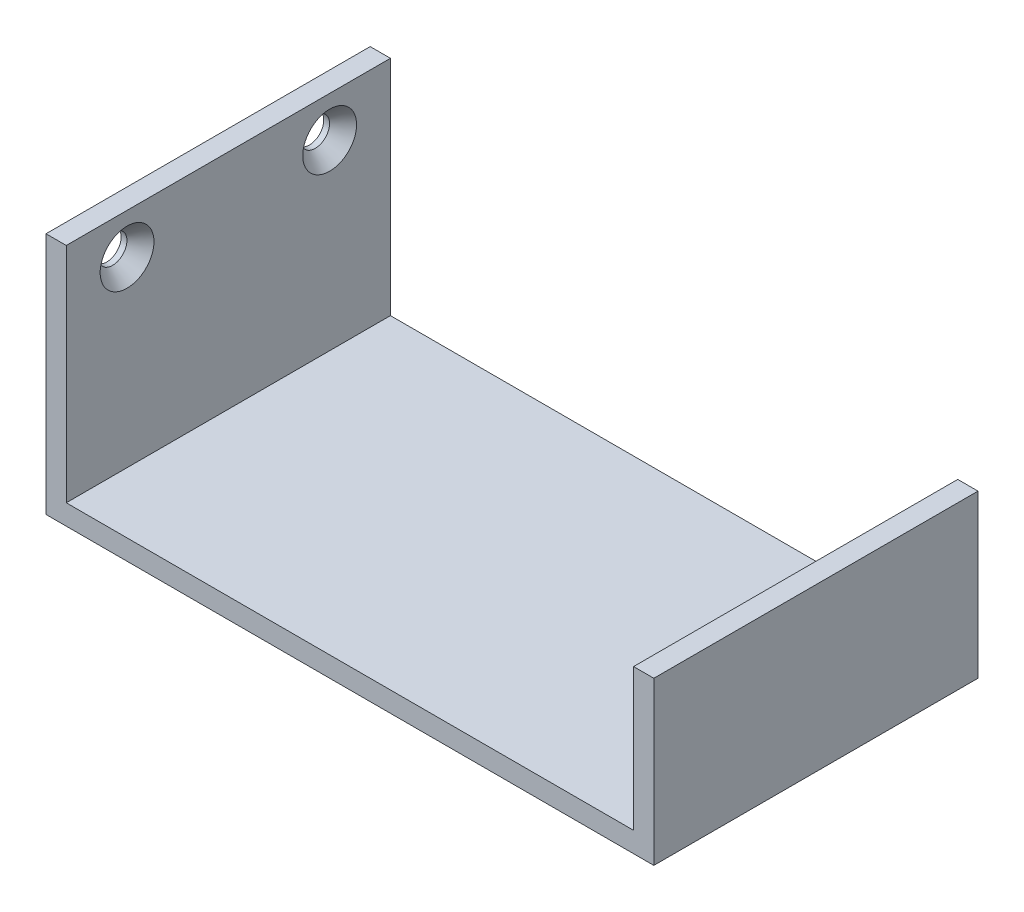
ISO-10303-21;
HEADER;
FILE_DESCRIPTION(('STEP AP214'),'2;1');
FILE_NAME('part.step','',(''),(''),'','','');
FILE_SCHEMA(('AUTOMOTIVE_DESIGN { 1 0 10303 214 1 1 1 1 }'));
ENDSEC;
DATA;
#1=APPLICATION_CONTEXT('core data for automotive mechanical design processes');
#2=APPLICATION_PROTOCOL_DEFINITION('international standard','automotive_design',2000,#1);
#3=PRODUCT_CONTEXT('',#1,'mechanical');
#4=PRODUCT('Part','Part','',(#3));
#5=PRODUCT_RELATED_PRODUCT_CATEGORY('part','',(#4));
#6=PRODUCT_DEFINITION_FORMATION('','',#4);
#7=PRODUCT_DEFINITION_CONTEXT('part definition',#1,'design');
#8=PRODUCT_DEFINITION('design','',#6,#7);
#9=PRODUCT_DEFINITION_SHAPE('','',#8);
#10=(LENGTH_UNIT() NAMED_UNIT(*) SI_UNIT(.MILLI.,.METRE.));
#11=(NAMED_UNIT(*) PLANE_ANGLE_UNIT() SI_UNIT($,.RADIAN.));
#12=(NAMED_UNIT(*) SI_UNIT($,.STERADIAN.) SOLID_ANGLE_UNIT());
#13=UNCERTAINTY_MEASURE_WITH_UNIT(LENGTH_MEASURE(1.E-05),#10,'distance_accuracy_value','');
#14=(GEOMETRIC_REPRESENTATION_CONTEXT(3) GLOBAL_UNCERTAINTY_ASSIGNED_CONTEXT((#13)) GLOBAL_UNIT_ASSIGNED_CONTEXT((#10,
#11,#12)) REPRESENTATION_CONTEXT('',''));
#15=CARTESIAN_POINT('',(0.,0.,0.));
#16=DIRECTION('',(0.,0.,1.));
#17=DIRECTION('',(1.,0.,0.));
#18=AXIS2_PLACEMENT_3D('',#15,#16,#17);
#19=CARTESIAN_POINT('',(95.25,0.,50.8));
#20=DIRECTION('',(0.,1.,0.));
#21=DIRECTION('',(-1.,0.,0.));
#22=AXIS2_PLACEMENT_3D('',#19,#20,#21);
#23=PLANE('',#22);
#24=DIRECTION('',(1.,0.,0.));
#25=VECTOR('',#24,1.);
#26=CARTESIAN_POINT('',(95.25,0.,0.));
#27=LINE('',#26,#25);
#28=CARTESIAN_POINT('',(0.,0.,0.));
#29=VERTEX_POINT('',#28);
#30=CARTESIAN_POINT('',(95.25,0.,0.));
#31=VERTEX_POINT('',#30);
#32=EDGE_CURVE('E140',#29,#31,#27,.T.);
#33=ORIENTED_EDGE('',*,*,#32,.T.);
#34=DIRECTION('',(0.,0.,-1.));
#35=VECTOR('',#34,1.);
#36=CARTESIAN_POINT('',(95.25,0.,50.8));
#37=LINE('',#36,#35);
#38=CARTESIAN_POINT('',(95.25,0.,50.8));
#39=VERTEX_POINT('',#38);
#40=EDGE_CURVE('E11',#39,#31,#37,.T.);
#41=ORIENTED_EDGE('',*,*,#40,.F.);
#42=DIRECTION('',(1.,0.,0.));
#43=VECTOR('',#42,1.);
#44=CARTESIAN_POINT('',(95.25,0.,50.8));
#45=LINE('',#44,#43);
#46=CARTESIAN_POINT('',(0.,0.,50.8));
#47=VERTEX_POINT('',#46);
#48=EDGE_CURVE('E163',#47,#39,#45,.T.);
#49=ORIENTED_EDGE('',*,*,#48,.F.);
#50=DIRECTION('',(0.,0.,-1.));
#51=VECTOR('',#50,1.);
#52=CARTESIAN_POINT('',(0.,0.,50.8));
#53=LINE('',#52,#51);
#54=EDGE_CURVE('E136',#47,#29,#53,.T.);
#55=ORIENTED_EDGE('',*,*,#54,.T.);
#56=EDGE_LOOP('',(#33,#41,#49,#55));
#57=FACE_BOUND('',#56,.T.);
#58=ADVANCED_FACE('F39',(#57),#23,.F.);
#59=CARTESIAN_POINT('',(95.25,25.4,50.8));
#60=DIRECTION('',(-1.,0.,0.));
#61=DIRECTION('',(0.,-1.,0.));
#62=AXIS2_PLACEMENT_3D('',#59,#60,#61);
#63=PLANE('',#62);
#64=DIRECTION('',(0.,1.,0.));
#65=VECTOR('',#64,1.);
#66=CARTESIAN_POINT('',(95.25,25.4,0.));
#67=LINE('',#66,#65);
#68=CARTESIAN_POINT('',(95.25,25.4,0.));
#69=VERTEX_POINT('',#68);
#70=EDGE_CURVE('E144',#31,#69,#67,.T.);
#71=ORIENTED_EDGE('',*,*,#70,.T.);
#72=DIRECTION('',(0.,0.,-1.));
#73=VECTOR('',#72,1.);
#74=CARTESIAN_POINT('',(95.25,25.4,50.8));
#75=LINE('',#74,#73);
#76=CARTESIAN_POINT('',(95.25,25.4,50.8));
#77=VERTEX_POINT('',#76);
#78=EDGE_CURVE('E48',#77,#69,#75,.T.);
#79=ORIENTED_EDGE('',*,*,#78,.F.);
#80=DIRECTION('',(0.,1.,0.));
#81=VECTOR('',#80,1.);
#82=CARTESIAN_POINT('',(95.25,25.4,50.8));
#83=LINE('',#82,#81);
#84=EDGE_CURVE('E99',#39,#77,#83,.T.);
#85=ORIENTED_EDGE('',*,*,#84,.F.);
#86=ORIENTED_EDGE('',*,*,#40,.T.);
#87=EDGE_LOOP('',(#71,#79,#85,#86));
#88=FACE_BOUND('',#87,.T.);
#89=ADVANCED_FACE('F254',(#88),#63,.F.);
#90=CARTESIAN_POINT('',(92.075,25.4,50.8));
#91=DIRECTION('',(0.,-1.,0.));
#92=DIRECTION('',(0.,0.,-1.));
#93=AXIS2_PLACEMENT_3D('',#90,#91,#92);
#94=PLANE('',#93);
#95=DIRECTION('',(-1.,0.,0.));
#96=VECTOR('',#95,1.);
#97=CARTESIAN_POINT('',(92.075,25.4,0.));
#98=LINE('',#97,#96);
#99=CARTESIAN_POINT('',(92.075,25.4,0.));
#100=VERTEX_POINT('',#99);
#101=EDGE_CURVE('E148',#69,#100,#98,.T.);
#102=ORIENTED_EDGE('',*,*,#101,.T.);
#103=DIRECTION('',(0.,0.,-1.));
#104=VECTOR('',#103,1.);
#105=CARTESIAN_POINT('',(92.075,25.4,50.8));
#106=LINE('',#105,#104);
#107=CARTESIAN_POINT('',(92.075,25.4,50.8));
#108=VERTEX_POINT('',#107);
#109=EDGE_CURVE('E174',#108,#100,#106,.T.);
#110=ORIENTED_EDGE('',*,*,#109,.F.);
#111=DIRECTION('',(-1.,0.,0.));
#112=VECTOR('',#111,1.);
#113=CARTESIAN_POINT('',(92.075,25.4,50.8));
#114=LINE('',#113,#112);
#115=EDGE_CURVE('E184',#77,#108,#114,.T.);
#116=ORIENTED_EDGE('',*,*,#115,.F.);
#117=ORIENTED_EDGE('',*,*,#78,.T.);
#118=EDGE_LOOP('',(#102,#110,#116,#117));
#119=FACE_BOUND('',#118,.T.);
#120=ADVANCED_FACE('F182',(#119),#94,.F.);
#121=CARTESIAN_POINT('',(92.075,3.175,50.8));
#122=DIRECTION('',(1.,0.,0.));
#123=DIRECTION('',(0.,0.,-1.));
#124=AXIS2_PLACEMENT_3D('',#121,#122,#123);
#125=PLANE('',#124);
#126=DIRECTION('',(0.,-1.,0.));
#127=VECTOR('',#126,1.);
#128=CARTESIAN_POINT('',(92.075,3.175,0.));
#129=LINE('',#128,#127);
#130=CARTESIAN_POINT('',(92.075,3.175,0.));
#131=VERTEX_POINT('',#130);
#132=EDGE_CURVE('E151',#100,#131,#129,.T.);
#133=ORIENTED_EDGE('',*,*,#132,.T.);
#134=DIRECTION('',(0.,0.,-1.));
#135=VECTOR('',#134,1.);
#136=CARTESIAN_POINT('',(92.075,3.175,50.8));
#137=LINE('',#136,#135);
#138=CARTESIAN_POINT('',(92.075,3.175,50.8));
#139=VERTEX_POINT('',#138);
#140=EDGE_CURVE('E170',#139,#131,#137,.T.);
#141=ORIENTED_EDGE('',*,*,#140,.F.);
#142=DIRECTION('',(0.,-1.,0.));
#143=VECTOR('',#142,1.);
#144=CARTESIAN_POINT('',(92.075,3.175,50.8));
#145=LINE('',#144,#143);
#146=EDGE_CURVE('E197',#108,#139,#145,.T.);
#147=ORIENTED_EDGE('',*,*,#146,.F.);
#148=ORIENTED_EDGE('',*,*,#109,.T.);
#149=EDGE_LOOP('',(#133,#141,#147,#148));
#150=FACE_BOUND('',#149,.T.);
#151=ADVANCED_FACE('F192',(#150),#125,.F.);
#152=CARTESIAN_POINT('',(3.175,3.175,50.8));
#153=DIRECTION('',(0.,-1.,0.));
#154=DIRECTION('',(1.,0.,0.));
#155=AXIS2_PLACEMENT_3D('',#152,#153,#154);
#156=PLANE('',#155);
#157=DIRECTION('',(-1.,0.,0.));
#158=VECTOR('',#157,1.);
#159=CARTESIAN_POINT('',(3.175,3.175,0.));
#160=LINE('',#159,#158);
#161=CARTESIAN_POINT('',(3.175,3.175,0.));
#162=VERTEX_POINT('',#161);
#163=EDGE_CURVE('E154',#131,#162,#160,.T.);
#164=ORIENTED_EDGE('',*,*,#163,.T.);
#165=DIRECTION('',(0.,0.,-1.));
#166=VECTOR('',#165,1.);
#167=CARTESIAN_POINT('',(3.175,3.175,50.8));
#168=LINE('',#167,#166);
#169=CARTESIAN_POINT('',(3.175,3.175,50.8));
#170=VERTEX_POINT('',#169);
#171=EDGE_CURVE('E129',#170,#162,#168,.T.);
#172=ORIENTED_EDGE('',*,*,#171,.F.);
#173=DIRECTION('',(-1.,0.,0.));
#174=VECTOR('',#173,1.);
#175=CARTESIAN_POINT('',(3.175,3.175,50.8));
#176=LINE('',#175,#174);
#177=EDGE_CURVE('E118',#139,#170,#176,.T.);
#178=ORIENTED_EDGE('',*,*,#177,.F.);
#179=ORIENTED_EDGE('',*,*,#140,.T.);
#180=EDGE_LOOP('',(#164,#172,#178,#179));
#181=FACE_BOUND('',#180,.T.);
#182=ADVANCED_FACE('F195',(#181),#156,.F.);
#183=CARTESIAN_POINT('',(3.175,38.1,50.8));
#184=DIRECTION('',(-1.,0.,0.));
#185=DIRECTION('',(0.,-1.,0.));
#186=AXIS2_PLACEMENT_3D('',#183,#184,#185);
#187=PLANE('',#186);
#188=CARTESIAN_POINT('',(3.175,31.75,41.275));
#189=DIRECTION('',(1.,0.,0.));
#190=DIRECTION('',(0.,0.,-1.));
#191=AXIS2_PLACEMENT_3D('',#188,#189,#190);
#192=CIRCLE('',#191,4.2164);
#193=CARTESIAN_POINT('',(3.175,31.75,37.0586));
#194=VERTEX_POINT('',#193);
#195=EDGE_CURVE('E226',#194,#194,#192,.T.);
#196=ORIENTED_EDGE('',*,*,#195,.F.);
#197=EDGE_LOOP('',(#196));
#198=FACE_BOUND('',#197,.T.);
#199=CARTESIAN_POINT('',(3.175,31.75,9.525));
#200=DIRECTION('',(1.,0.,0.));
#201=DIRECTION('',(0.,0.,-1.));
#202=AXIS2_PLACEMENT_3D('',#199,#200,#201);
#203=CIRCLE('',#202,4.2164);
#204=CARTESIAN_POINT('',(3.175,31.75,5.3086));
#205=VERTEX_POINT('',#204);
#206=EDGE_CURVE('E214',#205,#205,#203,.T.);
#207=ORIENTED_EDGE('',*,*,#206,.F.);
#208=EDGE_LOOP('',(#207));
#209=FACE_BOUND('',#208,.T.);
#210=DIRECTION('',(0.,1.,0.));
#211=VECTOR('',#210,1.);
#212=CARTESIAN_POINT('',(3.175,38.1,0.));
#213=LINE('',#212,#211);
#214=CARTESIAN_POINT('',(3.175,38.1,0.));
#215=VERTEX_POINT('',#214);
#216=EDGE_CURVE('E127',#162,#215,#213,.T.);
#217=ORIENTED_EDGE('',*,*,#216,.T.);
#218=DIRECTION('',(0.,0.,-1.));
#219=VECTOR('',#218,1.);
#220=CARTESIAN_POINT('',(3.175,38.1,50.8));
#221=LINE('',#220,#219);
#222=CARTESIAN_POINT('',(3.175,38.1,50.8));
#223=VERTEX_POINT('',#222);
#224=EDGE_CURVE('E124',#223,#215,#221,.T.);
#225=ORIENTED_EDGE('',*,*,#224,.F.);
#226=DIRECTION('',(0.,1.,0.));
#227=VECTOR('',#226,1.);
#228=CARTESIAN_POINT('',(3.175,38.1,50.8));
#229=LINE('',#228,#227);
#230=EDGE_CURVE('E112',#170,#223,#229,.T.);
#231=ORIENTED_EDGE('',*,*,#230,.F.);
#232=ORIENTED_EDGE('',*,*,#171,.T.);
#233=EDGE_LOOP('',(#217,#225,#231,#232));
#234=FACE_BOUND('',#233,.T.);
#235=ADVANCED_FACE('F125',(#198,#209,#234),#187,.F.);
#236=CARTESIAN_POINT('',(0.,38.1,50.8));
#237=DIRECTION('',(0.,-1.,0.));
#238=DIRECTION('',(0.,0.,-1.));
#239=AXIS2_PLACEMENT_3D('',#236,#237,#238);
#240=PLANE('',#239);
#241=DIRECTION('',(-1.,0.,0.));
#242=VECTOR('',#241,1.);
#243=CARTESIAN_POINT('',(0.,38.1,0.));
#244=LINE('',#243,#242);
#245=CARTESIAN_POINT('',(0.,38.1,0.));
#246=VERTEX_POINT('',#245);
#247=EDGE_CURVE('E85',#215,#246,#244,.T.);
#248=ORIENTED_EDGE('',*,*,#247,.T.);
#249=DIRECTION('',(0.,0.,-1.));
#250=VECTOR('',#249,1.);
#251=CARTESIAN_POINT('',(0.,38.1,50.8));
#252=LINE('',#251,#250);
#253=CARTESIAN_POINT('',(0.,38.1,50.8));
#254=VERTEX_POINT('',#253);
#255=EDGE_CURVE('E130',#254,#246,#252,.T.);
#256=ORIENTED_EDGE('',*,*,#255,.F.);
#257=DIRECTION('',(-1.,0.,0.));
#258=VECTOR('',#257,1.);
#259=CARTESIAN_POINT('',(0.,38.1,50.8));
#260=LINE('',#259,#258);
#261=EDGE_CURVE('E116',#223,#254,#260,.T.);
#262=ORIENTED_EDGE('',*,*,#261,.F.);
#263=ORIENTED_EDGE('',*,*,#224,.T.);
#264=EDGE_LOOP('',(#248,#256,#262,#263));
#265=FACE_BOUND('',#264,.T.);
#266=ADVANCED_FACE('F132',(#265),#240,.F.);
#267=CARTESIAN_POINT('',(0.,0.,50.8));
#268=DIRECTION('',(1.,0.,0.));
#269=DIRECTION('',(0.,0.,-1.));
#270=AXIS2_PLACEMENT_3D('',#267,#268,#269);
#271=PLANE('',#270);
#272=CARTESIAN_POINT('',(0.,31.75,41.275));
#273=DIRECTION('',(1.,0.,0.));
#274=DIRECTION('',(0.,0.,-1.));
#275=AXIS2_PLACEMENT_3D('',#272,#273,#274);
#276=CIRCLE('',#275,2.2479);
#277=CARTESIAN_POINT('',(0.,31.75,39.0271));
#278=VERTEX_POINT('',#277);
#279=EDGE_CURVE('E218',#278,#278,#276,.T.);
#280=ORIENTED_EDGE('',*,*,#279,.T.);
#281=EDGE_LOOP('',(#280));
#282=FACE_BOUND('',#281,.T.);
#283=CARTESIAN_POINT('',(0.,31.75,9.525));
#284=DIRECTION('',(1.,0.,0.));
#285=DIRECTION('',(0.,0.,-1.));
#286=AXIS2_PLACEMENT_3D('',#283,#284,#285);
#287=CIRCLE('',#286,2.2479);
#288=CARTESIAN_POINT('',(0.,31.75,7.2771));
#289=VERTEX_POINT('',#288);
#290=EDGE_CURVE('E145',#289,#289,#287,.T.);
#291=ORIENTED_EDGE('',*,*,#290,.T.);
#292=EDGE_LOOP('',(#291));
#293=FACE_BOUND('',#292,.T.);
#294=DIRECTION('',(0.,-1.,0.));
#295=VECTOR('',#294,1.);
#296=CARTESIAN_POINT('',(0.,0.,0.));
#297=LINE('',#296,#295);
#298=EDGE_CURVE('E91',#246,#29,#297,.T.);
#299=ORIENTED_EDGE('',*,*,#298,.T.);
#300=ORIENTED_EDGE('',*,*,#54,.F.);
#301=DIRECTION('',(0.,-1.,0.));
#302=VECTOR('',#301,1.);
#303=CARTESIAN_POINT('',(0.,0.,50.8));
#304=LINE('',#303,#302);
#305=EDGE_CURVE('E56',#254,#47,#304,.T.);
#306=ORIENTED_EDGE('',*,*,#305,.F.);
#307=ORIENTED_EDGE('',*,*,#255,.T.);
#308=EDGE_LOOP('',(#299,#300,#306,#307));
#309=FACE_BOUND('',#308,.T.);
#310=ADVANCED_FACE('F261',(#282,#293,#309),#271,.F.);
#311=CARTESIAN_POINT('',(0.,0.,50.8));
#312=DIRECTION('',(0.,0.,-1.));
#313=DIRECTION('',(-1.,0.,0.));
#314=AXIS2_PLACEMENT_3D('',#311,#312,#313);
#315=PLANE('',#314);
#316=ORIENTED_EDGE('',*,*,#48,.T.);
#317=ORIENTED_EDGE('',*,*,#84,.T.);
#318=ORIENTED_EDGE('',*,*,#115,.T.);
#319=ORIENTED_EDGE('',*,*,#146,.T.);
#320=ORIENTED_EDGE('',*,*,#177,.T.);
#321=ORIENTED_EDGE('',*,*,#230,.T.);
#322=ORIENTED_EDGE('',*,*,#261,.T.);
#323=ORIENTED_EDGE('',*,*,#305,.T.);
#324=EDGE_LOOP('',(#316,#317,#318,#319,#320,#321,#322,#323));
#325=FACE_BOUND('',#324,.T.);
#326=ADVANCED_FACE('F114',(#325),#315,.F.);
#327=CARTESIAN_POINT('',(0.,0.,0.));
#328=DIRECTION('',(0.,0.,-1.));
#329=DIRECTION('',(-1.,0.,0.));
#330=AXIS2_PLACEMENT_3D('',#327,#328,#329);
#331=PLANE('',#330);
#332=ORIENTED_EDGE('',*,*,#32,.F.);
#333=ORIENTED_EDGE('',*,*,#298,.F.);
#334=ORIENTED_EDGE('',*,*,#247,.F.);
#335=ORIENTED_EDGE('',*,*,#216,.F.);
#336=ORIENTED_EDGE('',*,*,#163,.F.);
#337=ORIENTED_EDGE('',*,*,#132,.F.);
#338=ORIENTED_EDGE('',*,*,#101,.F.);
#339=ORIENTED_EDGE('',*,*,#70,.F.);
#340=EDGE_LOOP('',(#332,#333,#334,#335,#336,#337,#338,#339));
#341=FACE_BOUND('',#340,.T.);
#342=ADVANCED_FACE('F188',(#341),#331,.T.);
#343=CARTESIAN_POINT('',(3.175,31.75,9.525));
#344=DIRECTION('',(1.,0.,0.));
#345=DIRECTION('',(0.,0.,-1.));
#346=AXIS2_PLACEMENT_3D('',#343,#344,#345);
#347=CYLINDRICAL_SURFACE('',#346,2.2479);
#348=ORIENTED_EDGE('',*,*,#290,.F.);
#349=EDGE_LOOP('',(#348));
#350=FACE_BOUND('',#349,.T.);
#351=CARTESIAN_POINT('',(0.910499790385443,31.75,9.525));
#352=DIRECTION('',(1.,0.,0.));
#353=DIRECTION('',(0.,0.,-1.));
#354=AXIS2_PLACEMENT_3D('',#351,#352,#353);
#355=CIRCLE('',#354,2.2479);
#356=CARTESIAN_POINT('',(0.910499790385443,31.75,7.2771));
#357=VERTEX_POINT('',#356);
#358=EDGE_CURVE('E210',#357,#357,#355,.T.);
#359=ORIENTED_EDGE('',*,*,#358,.T.);
#360=EDGE_LOOP('',(#359));
#361=FACE_BOUND('',#360,.T.);
#362=ADVANCED_FACE('F241',(#350,#361),#347,.F.);
#363=CARTESIAN_POINT('',(3.175,31.75,9.525));
#364=DIRECTION('',(1.,0.,0.));
#365=DIRECTION('',(0.,0.,-1.));
#366=AXIS2_PLACEMENT_3D('',#363,#364,#365);
#367=CONICAL_SURFACE('',#366,4.2164,0.715584993317676);
#368=ORIENTED_EDGE('',*,*,#358,.F.);
#369=EDGE_LOOP('',(#368));
#370=FACE_BOUND('',#369,.T.);
#371=ORIENTED_EDGE('',*,*,#206,.T.);
#372=EDGE_LOOP('',(#371));
#373=FACE_BOUND('',#372,.T.);
#374=ADVANCED_FACE('F238',(#370,#373),#367,.F.);
#375=CARTESIAN_POINT('',(3.175,31.75,41.275));
#376=DIRECTION('',(1.,0.,0.));
#377=DIRECTION('',(0.,0.,-1.));
#378=AXIS2_PLACEMENT_3D('',#375,#376,#377);
#379=CYLINDRICAL_SURFACE('',#378,2.2479);
#380=ORIENTED_EDGE('',*,*,#279,.F.);
#381=EDGE_LOOP('',(#380));
#382=FACE_BOUND('',#381,.T.);
#383=CARTESIAN_POINT('',(0.910499790385443,31.75,41.275));
#384=DIRECTION('',(1.,0.,0.));
#385=DIRECTION('',(0.,0.,-1.));
#386=AXIS2_PLACEMENT_3D('',#383,#384,#385);
#387=CIRCLE('',#386,2.2479);
#388=CARTESIAN_POINT('',(0.910499790385443,31.75,39.0271));
#389=VERTEX_POINT('',#388);
#390=EDGE_CURVE('E222',#389,#389,#387,.T.);
#391=ORIENTED_EDGE('',*,*,#390,.T.);
#392=EDGE_LOOP('',(#391));
#393=FACE_BOUND('',#392,.T.);
#394=ADVANCED_FACE('F240',(#382,#393),#379,.F.);
#395=CARTESIAN_POINT('',(3.175,31.75,41.275));
#396=DIRECTION('',(1.,0.,0.));
#397=DIRECTION('',(0.,0.,-1.));
#398=AXIS2_PLACEMENT_3D('',#395,#396,#397);
#399=CONICAL_SURFACE('',#398,4.2164,0.715584993317676);
#400=ORIENTED_EDGE('',*,*,#390,.F.);
#401=EDGE_LOOP('',(#400));
#402=FACE_BOUND('',#401,.T.);
#403=ORIENTED_EDGE('',*,*,#195,.T.);
#404=EDGE_LOOP('',(#403));
#405=FACE_BOUND('',#404,.T.);
#406=ADVANCED_FACE('F231',(#402,#405),#399,.F.);
#407=CLOSED_SHELL('',(#58,#89,#120,#151,#182,#235,#266,#310,#326,#342,#362,#374,#394,#406));
#408=MANIFOLD_SOLID_BREP('B2',#407);
#409=ADVANCED_BREP_SHAPE_REPRESENTATION('',(#18,#408),#14);
#410=SHAPE_DEFINITION_REPRESENTATION(#9,#409);
ENDSEC;
END-ISO-10303-21;
